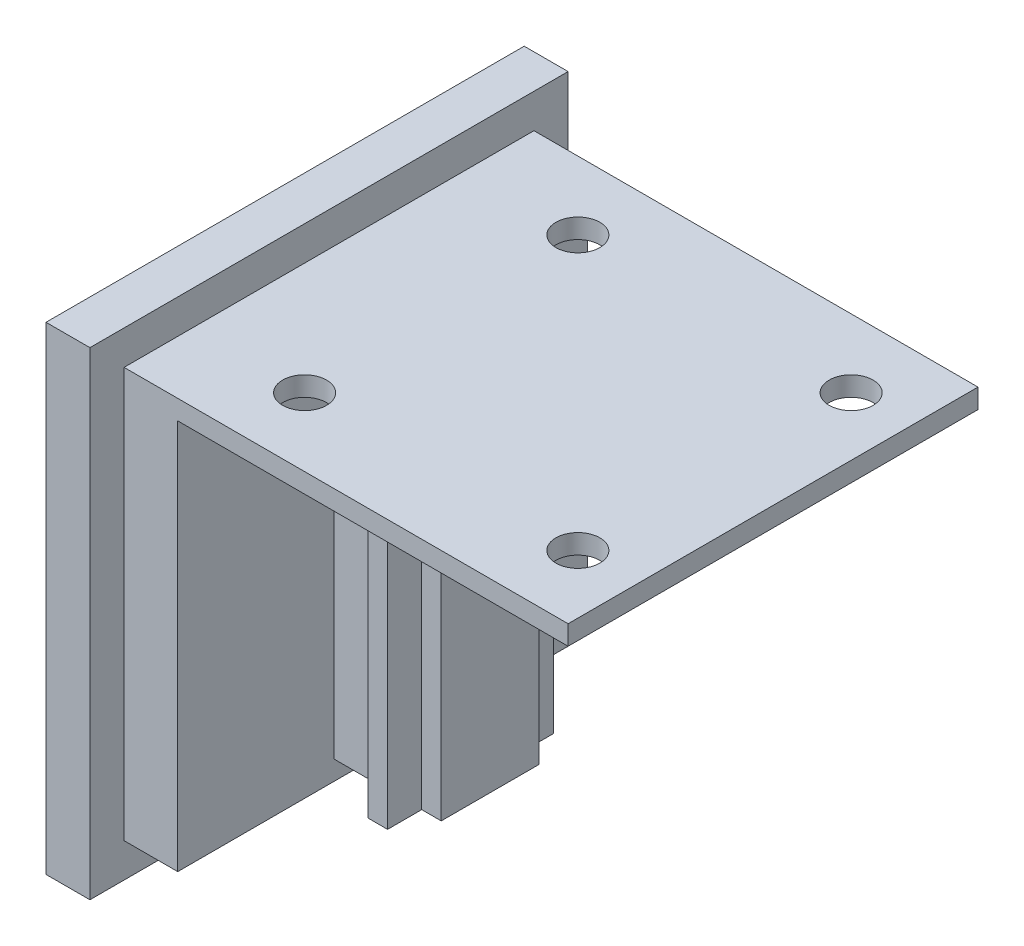
ISO-10303-21;
HEADER;
FILE_DESCRIPTION(('STEP AP214'),'2;1');
FILE_NAME('part.step','',(''),(''),'','','');
FILE_SCHEMA(('AUTOMOTIVE_DESIGN { 1 0 10303 214 1 1 1 1 }'));
ENDSEC;
DATA;
#1=APPLICATION_CONTEXT('core data for automotive mechanical design processes');
#2=APPLICATION_PROTOCOL_DEFINITION('international standard','automotive_design',2000,#1);
#3=PRODUCT_CONTEXT('',#1,'mechanical');
#4=PRODUCT('Part','Part','',(#3));
#5=PRODUCT_RELATED_PRODUCT_CATEGORY('part','',(#4));
#6=PRODUCT_DEFINITION_FORMATION('','',#4);
#7=PRODUCT_DEFINITION_CONTEXT('part definition',#1,'design');
#8=PRODUCT_DEFINITION('design','',#6,#7);
#9=PRODUCT_DEFINITION_SHAPE('','',#8);
#10=(LENGTH_UNIT() NAMED_UNIT(*) SI_UNIT(.MILLI.,.METRE.));
#11=(NAMED_UNIT(*) PLANE_ANGLE_UNIT() SI_UNIT($,.RADIAN.));
#12=(NAMED_UNIT(*) SI_UNIT($,.STERADIAN.) SOLID_ANGLE_UNIT());
#13=UNCERTAINTY_MEASURE_WITH_UNIT(LENGTH_MEASURE(1.E-05),#10,'distance_accuracy_value','');
#14=(GEOMETRIC_REPRESENTATION_CONTEXT(3) GLOBAL_UNCERTAINTY_ASSIGNED_CONTEXT((#13)) GLOBAL_UNIT_ASSIGNED_CONTEXT((#10,
#11,#12)) REPRESENTATION_CONTEXT('',''));
#15=CARTESIAN_POINT('',(0.,0.,0.));
#16=DIRECTION('',(0.,0.,1.));
#17=DIRECTION('',(1.,0.,0.));
#18=AXIS2_PLACEMENT_3D('',#15,#16,#17);
#19=CARTESIAN_POINT('',(50.,19.,-21.));
#20=DIRECTION('',(0.,1.,0.));
#21=DIRECTION('',(0.,0.,1.));
#22=AXIS2_PLACEMENT_3D('',#19,#20,#21);
#23=PLANE('',#22);
#24=CARTESIAN_POINT('',(44.,19.,-14.));
#25=DIRECTION('',(0.,-1.,0.));
#26=DIRECTION('',(0.,0.,-1.));
#27=AXIS2_PLACEMENT_3D('',#24,#25,#26);
#28=CIRCLE('',#27,2.25);
#29=CARTESIAN_POINT('',(44.,19.,-16.25));
#30=VERTEX_POINT('',#29);
#31=EDGE_CURVE('E655',#30,#30,#28,.T.);
#32=ORIENTED_EDGE('',*,*,#31,.F.);
#33=EDGE_LOOP('',(#32));
#34=FACE_BOUND('',#33,.T.);
#35=CARTESIAN_POINT('',(44.,19.,14.));
#36=DIRECTION('',(0.,-1.,0.));
#37=DIRECTION('',(0.,0.,-1.));
#38=AXIS2_PLACEMENT_3D('',#35,#36,#37);
#39=CIRCLE('',#38,2.25);
#40=CARTESIAN_POINT('',(44.,19.,11.75));
#41=VERTEX_POINT('',#40);
#42=EDGE_CURVE('E649',#41,#41,#39,.T.);
#43=ORIENTED_EDGE('',*,*,#42,.F.);
#44=EDGE_LOOP('',(#43));
#45=FACE_BOUND('',#44,.T.);
#46=CARTESIAN_POINT('',(16.,19.,14.));
#47=DIRECTION('',(0.,-1.,0.));
#48=DIRECTION('',(0.,0.,-1.));
#49=AXIS2_PLACEMENT_3D('',#46,#47,#48);
#50=CIRCLE('',#49,2.25);
#51=CARTESIAN_POINT('',(16.,19.,11.75));
#52=VERTEX_POINT('',#51);
#53=EDGE_CURVE('E643',#52,#52,#50,.T.);
#54=ORIENTED_EDGE('',*,*,#53,.F.);
#55=EDGE_LOOP('',(#54));
#56=FACE_BOUND('',#55,.T.);
#57=CARTESIAN_POINT('',(16.,19.,-14.));
#58=DIRECTION('',(0.,-1.,0.));
#59=DIRECTION('',(0.,0.,-1.));
#60=AXIS2_PLACEMENT_3D('',#57,#58,#59);
#61=CIRCLE('',#60,2.25);
#62=CARTESIAN_POINT('',(16.,19.,-16.25));
#63=VERTEX_POINT('',#62);
#64=EDGE_CURVE('E637',#63,#63,#61,.T.);
#65=ORIENTED_EDGE('',*,*,#64,.F.);
#66=EDGE_LOOP('',(#65));
#67=FACE_BOUND('',#66,.T.);
#68=DIRECTION('',(0.,0.,1.));
#69=VECTOR('',#68,1.);
#70=CARTESIAN_POINT('',(17.,19.,-8.5));
#71=LINE('',#70,#69);
#72=CARTESIAN_POINT('',(17.,19.,-8.5));
#73=VERTEX_POINT('',#72);
#74=CARTESIAN_POINT('',(17.,19.,-5.));
#75=VERTEX_POINT('',#74);
#76=EDGE_CURVE('E212',#73,#75,#71,.T.);
#77=ORIENTED_EDGE('',*,*,#76,.T.);
#78=DIRECTION('',(-1.,0.,0.));
#79=VECTOR('',#78,1.);
#80=CARTESIAN_POINT('',(21.,19.,-5.));
#81=LINE('',#80,#79);
#82=CARTESIAN_POINT('',(10.,19.,-5.));
#83=VERTEX_POINT('',#82);
#84=EDGE_CURVE('E264',#75,#83,#81,.T.);
#85=ORIENTED_EDGE('',*,*,#84,.T.);
#86=DIRECTION('',(0.,0.,-1.));
#87=VECTOR('',#86,1.);
#88=CARTESIAN_POINT('',(10.,19.,-21.));
#89=LINE('',#88,#87);
#90=CARTESIAN_POINT('',(10.,19.,-21.));
#91=VERTEX_POINT('',#90);
#92=EDGE_CURVE('E267',#83,#91,#89,.T.);
#93=ORIENTED_EDGE('',*,*,#92,.T.);
#94=DIRECTION('',(-1.,0.,0.));
#95=VECTOR('',#94,1.);
#96=CARTESIAN_POINT('',(50.,19.,-21.));
#97=LINE('',#96,#95);
#98=CARTESIAN_POINT('',(50.,19.,-21.));
#99=VERTEX_POINT('',#98);
#100=EDGE_CURVE('E280',#99,#91,#97,.T.);
#101=ORIENTED_EDGE('',*,*,#100,.F.);
#102=DIRECTION('',(0.,0.,-1.));
#103=VECTOR('',#102,1.);
#104=CARTESIAN_POINT('',(50.,19.,-21.));
#105=LINE('',#104,#103);
#106=CARTESIAN_POINT('',(50.,19.,21.));
#107=VERTEX_POINT('',#106);
#108=EDGE_CURVE('E271',#107,#99,#105,.T.);
#109=ORIENTED_EDGE('',*,*,#108,.F.);
#110=DIRECTION('',(-1.,0.,0.));
#111=VECTOR('',#110,1.);
#112=CARTESIAN_POINT('',(50.,19.,21.));
#113=LINE('',#112,#111);
#114=CARTESIAN_POINT('',(10.,19.,21.));
#115=VERTEX_POINT('',#114);
#116=EDGE_CURVE('E285',#107,#115,#113,.T.);
#117=ORIENTED_EDGE('',*,*,#116,.T.);
#118=CARTESIAN_POINT('',(10.,19.,5.));
#119=VERTEX_POINT('',#118);
#120=EDGE_CURVE('E272',#115,#119,#89,.T.);
#121=ORIENTED_EDGE('',*,*,#120,.T.);
#122=DIRECTION('',(-1.,0.,0.));
#123=VECTOR('',#122,1.);
#124=CARTESIAN_POINT('',(21.,19.,5.));
#125=LINE('',#124,#123);
#126=CARTESIAN_POINT('',(17.,19.,5.));
#127=VERTEX_POINT('',#126);
#128=EDGE_CURVE('E260',#127,#119,#125,.T.);
#129=ORIENTED_EDGE('',*,*,#128,.F.);
#130=DIRECTION('',(0.,0.,-1.));
#131=VECTOR('',#130,1.);
#132=CARTESIAN_POINT('',(17.,19.,8.5));
#133=LINE('',#132,#131);
#134=CARTESIAN_POINT('',(17.,19.,8.5));
#135=VERTEX_POINT('',#134);
#136=EDGE_CURVE('E231',#135,#127,#133,.T.);
#137=ORIENTED_EDGE('',*,*,#136,.F.);
#138=DIRECTION('',(-1.,0.,0.));
#139=VECTOR('',#138,1.);
#140=CARTESIAN_POINT('',(17.,19.,8.5));
#141=LINE('',#140,#139);
#142=CARTESIAN_POINT('',(19.,19.,8.5));
#143=VERTEX_POINT('',#142);
#144=EDGE_CURVE('E217',#143,#135,#141,.T.);
#145=ORIENTED_EDGE('',*,*,#144,.F.);
#146=DIRECTION('',(0.,0.,-1.));
#147=VECTOR('',#146,1.);
#148=CARTESIAN_POINT('',(19.,19.,8.5));
#149=LINE('',#148,#147);
#150=CARTESIAN_POINT('',(19.,19.,5.));
#151=VERTEX_POINT('',#150);
#152=EDGE_CURVE('E233',#143,#151,#149,.T.);
#153=ORIENTED_EDGE('',*,*,#152,.T.);
#154=CARTESIAN_POINT('',(21.,19.,5.));
#155=VERTEX_POINT('',#154);
#156=EDGE_CURVE('E261',#155,#151,#125,.T.);
#157=ORIENTED_EDGE('',*,*,#156,.F.);
#158=DIRECTION('',(0.,0.,1.));
#159=VECTOR('',#158,1.);
#160=CARTESIAN_POINT('',(21.,19.,5.));
#161=LINE('',#160,#159);
#162=CARTESIAN_POINT('',(21.,19.,-5.));
#163=VERTEX_POINT('',#162);
#164=EDGE_CURVE('E240',#163,#155,#161,.T.);
#165=ORIENTED_EDGE('',*,*,#164,.F.);
#166=CARTESIAN_POINT('',(19.,19.,-5.));
#167=VERTEX_POINT('',#166);
#168=EDGE_CURVE('E265',#163,#167,#81,.T.);
#169=ORIENTED_EDGE('',*,*,#168,.T.);
#170=DIRECTION('',(0.,0.,1.));
#171=VECTOR('',#170,1.);
#172=CARTESIAN_POINT('',(19.,19.,-8.5));
#173=LINE('',#172,#171);
#174=CARTESIAN_POINT('',(19.,19.,-8.5));
#175=VERTEX_POINT('',#174);
#176=EDGE_CURVE('E53',#175,#167,#173,.T.);
#177=ORIENTED_EDGE('',*,*,#176,.F.);
#178=DIRECTION('',(1.,0.,0.));
#179=VECTOR('',#178,1.);
#180=CARTESIAN_POINT('',(19.,19.,-8.5));
#181=LINE('',#180,#179);
#182=EDGE_CURVE('E48',#73,#175,#181,.T.);
#183=ORIENTED_EDGE('',*,*,#182,.F.);
#184=EDGE_LOOP('',(#77,#85,#93,#101,#109,#117,#121,#129,#137,#145,#153,#157,#165,#169,#177,#183));
#185=FACE_BOUND('',#184,.T.);
#186=ADVANCED_FACE('F33',(#34,#45,#56,#67,#185),#23,.F.);
#187=CARTESIAN_POINT('',(21.,19.,-5.));
#188=DIRECTION('',(0.,0.,1.));
#189=DIRECTION('',(1.,0.,0.));
#190=AXIS2_PLACEMENT_3D('',#187,#188,#189);
#191=PLANE('',#190);
#192=DIRECTION('',(0.,1.,0.));
#193=VECTOR('',#192,1.);
#194=CARTESIAN_POINT('',(17.,19.,-5.));
#195=LINE('',#194,#193);
#196=CARTESIAN_POINT('',(17.,-19.,-5.));
#197=VERTEX_POINT('',#196);
#198=EDGE_CURVE('E205',#197,#75,#195,.T.);
#199=ORIENTED_EDGE('',*,*,#198,.F.);
#200=DIRECTION('',(-1.,0.,0.));
#201=VECTOR('',#200,1.);
#202=CARTESIAN_POINT('',(21.,-19.,-5.));
#203=LINE('',#202,#201);
#204=CARTESIAN_POINT('',(10.,-19.,-5.));
#205=VERTEX_POINT('',#204);
#206=EDGE_CURVE('E247',#197,#205,#203,.T.);
#207=ORIENTED_EDGE('',*,*,#206,.T.);
#208=DIRECTION('',(0.,1.,0.));
#209=VECTOR('',#208,1.);
#210=CARTESIAN_POINT('',(10.,19.,-5.));
#211=LINE('',#210,#209);
#212=EDGE_CURVE('E236',#205,#83,#211,.T.);
#213=ORIENTED_EDGE('',*,*,#212,.T.);
#214=ORIENTED_EDGE('',*,*,#84,.F.);
#215=EDGE_LOOP('',(#199,#207,#213,#214));
#216=FACE_BOUND('',#215,.T.);
#217=ADVANCED_FACE('F372',(#216),#191,.F.);
#218=DIRECTION('',(0.,-1.,0.));
#219=VECTOR('',#218,1.);
#220=CARTESIAN_POINT('',(19.,19.,-5.));
#221=LINE('',#220,#219);
#222=CARTESIAN_POINT('',(19.,-19.,-5.));
#223=VERTEX_POINT('',#222);
#224=EDGE_CURVE('E192',#167,#223,#221,.T.);
#225=ORIENTED_EDGE('',*,*,#224,.F.);
#226=ORIENTED_EDGE('',*,*,#168,.F.);
#227=DIRECTION('',(0.,1.,0.));
#228=VECTOR('',#227,1.);
#229=CARTESIAN_POINT('',(21.,19.,-5.));
#230=LINE('',#229,#228);
#231=CARTESIAN_POINT('',(21.,-19.,-5.));
#232=VERTEX_POINT('',#231);
#233=EDGE_CURVE('E237',#232,#163,#230,.T.);
#234=ORIENTED_EDGE('',*,*,#233,.F.);
#235=EDGE_CURVE('E254',#232,#223,#203,.T.);
#236=ORIENTED_EDGE('',*,*,#235,.T.);
#237=EDGE_LOOP('',(#225,#226,#234,#236));
#238=FACE_BOUND('',#237,.T.);
#239=ADVANCED_FACE('F379',(#238),#191,.F.);
#240=CARTESIAN_POINT('',(21.,19.,5.));
#241=DIRECTION('',(0.,0.,-1.));
#242=DIRECTION('',(-1.,0.,0.));
#243=AXIS2_PLACEMENT_3D('',#240,#241,#242);
#244=PLANE('',#243);
#245=DIRECTION('',(0.,1.,0.));
#246=VECTOR('',#245,1.);
#247=CARTESIAN_POINT('',(19.,19.,5.));
#248=LINE('',#247,#246);
#249=CARTESIAN_POINT('',(19.,-19.,5.));
#250=VERTEX_POINT('',#249);
#251=EDGE_CURVE('E214',#250,#151,#248,.T.);
#252=ORIENTED_EDGE('',*,*,#251,.F.);
#253=DIRECTION('',(-1.,0.,0.));
#254=VECTOR('',#253,1.);
#255=CARTESIAN_POINT('',(21.,-19.,5.));
#256=LINE('',#255,#254);
#257=CARTESIAN_POINT('',(21.,-19.,5.));
#258=VERTEX_POINT('',#257);
#259=EDGE_CURVE('E257',#258,#250,#256,.T.);
#260=ORIENTED_EDGE('',*,*,#259,.F.);
#261=DIRECTION('',(0.,-1.,0.));
#262=VECTOR('',#261,1.);
#263=CARTESIAN_POINT('',(21.,19.,5.));
#264=LINE('',#263,#262);
#265=EDGE_CURVE('E243',#155,#258,#264,.T.);
#266=ORIENTED_EDGE('',*,*,#265,.F.);
#267=ORIENTED_EDGE('',*,*,#156,.T.);
#268=EDGE_LOOP('',(#252,#260,#266,#267));
#269=FACE_BOUND('',#268,.T.);
#270=ADVANCED_FACE('F466',(#269),#244,.F.);
#271=DIRECTION('',(0.,-1.,0.));
#272=VECTOR('',#271,1.);
#273=CARTESIAN_POINT('',(17.,19.,5.));
#274=LINE('',#273,#272);
#275=CARTESIAN_POINT('',(17.,-19.,5.));
#276=VERTEX_POINT('',#275);
#277=EDGE_CURVE('E218',#127,#276,#274,.T.);
#278=ORIENTED_EDGE('',*,*,#277,.F.);
#279=ORIENTED_EDGE('',*,*,#128,.T.);
#280=DIRECTION('',(0.,-1.,0.));
#281=VECTOR('',#280,1.);
#282=CARTESIAN_POINT('',(10.,19.,5.));
#283=LINE('',#282,#281);
#284=CARTESIAN_POINT('',(10.,-19.,5.));
#285=VERTEX_POINT('',#284);
#286=EDGE_CURVE('E250',#119,#285,#283,.T.);
#287=ORIENTED_EDGE('',*,*,#286,.T.);
#288=EDGE_CURVE('E256',#276,#285,#256,.T.);
#289=ORIENTED_EDGE('',*,*,#288,.F.);
#290=EDGE_LOOP('',(#278,#279,#287,#289));
#291=FACE_BOUND('',#290,.T.);
#292=ADVANCED_FACE('F390',(#291),#244,.F.);
#293=CARTESIAN_POINT('',(10.,0.,0.));
#294=DIRECTION('',(1.,0.,0.));
#295=DIRECTION('',(0.,0.,-1.));
#296=AXIS2_PLACEMENT_3D('',#293,#294,#295);
#297=PLANE('',#296);
#298=ORIENTED_EDGE('',*,*,#92,.F.);
#299=ORIENTED_EDGE('',*,*,#212,.F.);
#300=DIRECTION('',(0.,0.,-1.));
#301=VECTOR('',#300,1.);
#302=CARTESIAN_POINT('',(10.,-19.,5.));
#303=LINE('',#302,#301);
#304=EDGE_CURVE('E241',#285,#205,#303,.T.);
#305=ORIENTED_EDGE('',*,*,#304,.F.);
#306=ORIENTED_EDGE('',*,*,#286,.F.);
#307=ORIENTED_EDGE('',*,*,#120,.F.);
#308=DIRECTION('',(0.,-1.,0.));
#309=VECTOR('',#308,1.);
#310=CARTESIAN_POINT('',(10.,21.,21.));
#311=LINE('',#310,#309);
#312=CARTESIAN_POINT('',(10.,-21.,21.));
#313=VERTEX_POINT('',#312);
#314=EDGE_CURVE('E292',#115,#313,#311,.T.);
#315=ORIENTED_EDGE('',*,*,#314,.T.);
#316=DIRECTION('',(0.,0.,-1.));
#317=VECTOR('',#316,1.);
#318=CARTESIAN_POINT('',(10.,-21.,21.));
#319=LINE('',#318,#317);
#320=CARTESIAN_POINT('',(10.,-21.,-21.));
#321=VERTEX_POINT('',#320);
#322=EDGE_CURVE('E295',#313,#321,#319,.T.);
#323=ORIENTED_EDGE('',*,*,#322,.T.);
#324=DIRECTION('',(0.,1.,0.));
#325=VECTOR('',#324,1.);
#326=CARTESIAN_POINT('',(10.,21.,-21.));
#327=LINE('',#326,#325);
#328=EDGE_CURVE('E289',#321,#91,#327,.T.);
#329=ORIENTED_EDGE('',*,*,#328,.T.);
#330=EDGE_LOOP('',(#298,#299,#305,#306,#307,#315,#323,#329));
#331=FACE_BOUND('',#330,.T.);
#332=ADVANCED_FACE('F387',(#331),#297,.T.);
#333=CARTESIAN_POINT('',(4.5,0.,0.));
#334=DIRECTION('',(-1.,0.,0.));
#335=DIRECTION('',(0.,0.,1.));
#336=AXIS2_PLACEMENT_3D('',#333,#334,#335);
#337=PLANE('',#336);
#338=DIRECTION('',(0.,-1.,0.));
#339=VECTOR('',#338,1.);
#340=CARTESIAN_POINT('',(4.5,24.5,24.5));
#341=LINE('',#340,#339);
#342=CARTESIAN_POINT('',(4.5,24.5,24.5));
#343=VERTEX_POINT('',#342);
#344=CARTESIAN_POINT('',(4.5,-24.5,24.5));
#345=VERTEX_POINT('',#344);
#346=EDGE_CURVE('E320',#343,#345,#341,.T.);
#347=ORIENTED_EDGE('',*,*,#346,.T.);
#348=DIRECTION('',(0.,0.,-1.));
#349=VECTOR('',#348,1.);
#350=CARTESIAN_POINT('',(4.5,-24.5,-24.5));
#351=LINE('',#350,#349);
#352=CARTESIAN_POINT('',(4.5,-24.5,-24.5));
#353=VERTEX_POINT('',#352);
#354=EDGE_CURVE('E323',#345,#353,#351,.T.);
#355=ORIENTED_EDGE('',*,*,#354,.T.);
#356=DIRECTION('',(0.,1.,0.));
#357=VECTOR('',#356,1.);
#358=CARTESIAN_POINT('',(4.5,24.5,-24.5));
#359=LINE('',#358,#357);
#360=CARTESIAN_POINT('',(4.5,24.5,-24.5));
#361=VERTEX_POINT('',#360);
#362=EDGE_CURVE('E326',#353,#361,#359,.T.);
#363=ORIENTED_EDGE('',*,*,#362,.T.);
#364=DIRECTION('',(0.,0.,1.));
#365=VECTOR('',#364,1.);
#366=CARTESIAN_POINT('',(4.5,24.5,-24.5));
#367=LINE('',#366,#365);
#368=EDGE_CURVE('E328',#361,#343,#367,.T.);
#369=ORIENTED_EDGE('',*,*,#368,.T.);
#370=EDGE_LOOP('',(#347,#355,#363,#369));
#371=FACE_BOUND('',#370,.T.);
#372=DIRECTION('',(0.,1.,0.));
#373=VECTOR('',#372,1.);
#374=CARTESIAN_POINT('',(4.5,21.,-21.));
#375=LINE('',#374,#373);
#376=CARTESIAN_POINT('',(4.5,-21.,-21.));
#377=VERTEX_POINT('',#376);
#378=CARTESIAN_POINT('',(4.5,21.,-21.));
#379=VERTEX_POINT('',#378);
#380=EDGE_CURVE('E288',#377,#379,#375,.T.);
#381=ORIENTED_EDGE('',*,*,#380,.F.);
#382=DIRECTION('',(0.,0.,-1.));
#383=VECTOR('',#382,1.);
#384=CARTESIAN_POINT('',(4.5,-21.,21.));
#385=LINE('',#384,#383);
#386=CARTESIAN_POINT('',(4.5,-21.,21.));
#387=VERTEX_POINT('',#386);
#388=EDGE_CURVE('E293',#387,#377,#385,.T.);
#389=ORIENTED_EDGE('',*,*,#388,.F.);
#390=DIRECTION('',(0.,-1.,0.));
#391=VECTOR('',#390,1.);
#392=CARTESIAN_POINT('',(4.5,21.,21.));
#393=LINE('',#392,#391);
#394=CARTESIAN_POINT('',(4.5,21.,21.));
#395=VERTEX_POINT('',#394);
#396=EDGE_CURVE('E303',#395,#387,#393,.T.);
#397=ORIENTED_EDGE('',*,*,#396,.F.);
#398=DIRECTION('',(0.,0.,1.));
#399=VECTOR('',#398,1.);
#400=CARTESIAN_POINT('',(4.5,21.,21.));
#401=LINE('',#400,#399);
#402=EDGE_CURVE('E300',#379,#395,#401,.T.);
#403=ORIENTED_EDGE('',*,*,#402,.F.);
#404=EDGE_LOOP('',(#381,#389,#397,#403));
#405=FACE_BOUND('',#404,.T.);
#406=ADVANCED_FACE('F362',(#371,#405),#337,.F.);
#407=CARTESIAN_POINT('',(4.5,24.5,24.5));
#408=DIRECTION('',(0.,0.,-1.));
#409=DIRECTION('',(0.,1.,0.));
#410=AXIS2_PLACEMENT_3D('',#407,#408,#409);
#411=PLANE('',#410);
#412=DIRECTION('',(0.,-1.,0.));
#413=VECTOR('',#412,1.);
#414=CARTESIAN_POINT('',(0.,24.5,24.5));
#415=LINE('',#414,#413);
#416=CARTESIAN_POINT('',(0.,24.5,24.5));
#417=VERTEX_POINT('',#416);
#418=CARTESIAN_POINT('',(0.,-24.5,24.5));
#419=VERTEX_POINT('',#418);
#420=EDGE_CURVE('E319',#417,#419,#415,.T.);
#421=ORIENTED_EDGE('',*,*,#420,.T.);
#422=DIRECTION('',(-1.,0.,0.));
#423=VECTOR('',#422,1.);
#424=CARTESIAN_POINT('',(4.5,-24.5,24.5));
#425=LINE('',#424,#423);
#426=EDGE_CURVE('E11',#345,#419,#425,.T.);
#427=ORIENTED_EDGE('',*,*,#426,.F.);
#428=ORIENTED_EDGE('',*,*,#346,.F.);
#429=DIRECTION('',(-1.,0.,0.));
#430=VECTOR('',#429,1.);
#431=CARTESIAN_POINT('',(4.5,24.5,24.5));
#432=LINE('',#431,#430);
#433=EDGE_CURVE('E330',#343,#417,#432,.T.);
#434=ORIENTED_EDGE('',*,*,#433,.T.);
#435=EDGE_LOOP('',(#421,#427,#428,#434));
#436=FACE_BOUND('',#435,.T.);
#437=ADVANCED_FACE('F35',(#436),#411,.F.);
#438=CARTESIAN_POINT('',(4.5,-24.5,-24.5));
#439=DIRECTION('',(0.,1.,0.));
#440=DIRECTION('',(0.,0.,1.));
#441=AXIS2_PLACEMENT_3D('',#438,#439,#440);
#442=PLANE('',#441);
#443=DIRECTION('',(0.,0.,-1.));
#444=VECTOR('',#443,1.);
#445=CARTESIAN_POINT('',(0.,-24.5,-24.5));
#446=LINE('',#445,#444);
#447=CARTESIAN_POINT('',(0.,-24.5,-24.5));
#448=VERTEX_POINT('',#447);
#449=EDGE_CURVE('E333',#419,#448,#446,.T.);
#450=ORIENTED_EDGE('',*,*,#449,.T.);
#451=DIRECTION('',(-1.,0.,0.));
#452=VECTOR('',#451,1.);
#453=CARTESIAN_POINT('',(4.5,-24.5,-24.5));
#454=LINE('',#453,#452);
#455=EDGE_CURVE('E41',#353,#448,#454,.T.);
#456=ORIENTED_EDGE('',*,*,#455,.F.);
#457=ORIENTED_EDGE('',*,*,#354,.F.);
#458=ORIENTED_EDGE('',*,*,#426,.T.);
#459=EDGE_LOOP('',(#450,#456,#457,#458));
#460=FACE_BOUND('',#459,.T.);
#461=ADVANCED_FACE('F364',(#460),#442,.F.);
#462=CARTESIAN_POINT('',(4.5,24.5,-24.5));
#463=DIRECTION('',(0.,0.,1.));
#464=DIRECTION('',(0.,-1.,0.));
#465=AXIS2_PLACEMENT_3D('',#462,#463,#464);
#466=PLANE('',#465);
#467=DIRECTION('',(0.,1.,0.));
#468=VECTOR('',#467,1.);
#469=CARTESIAN_POINT('',(0.,24.5,-24.5));
#470=LINE('',#469,#468);
#471=CARTESIAN_POINT('',(0.,24.5,-24.5));
#472=VERTEX_POINT('',#471);
#473=EDGE_CURVE('E335',#448,#472,#470,.T.);
#474=ORIENTED_EDGE('',*,*,#473,.T.);
#475=DIRECTION('',(-1.,0.,0.));
#476=VECTOR('',#475,1.);
#477=CARTESIAN_POINT('',(4.5,24.5,-24.5));
#478=LINE('',#477,#476);
#479=EDGE_CURVE('E340',#361,#472,#478,.T.);
#480=ORIENTED_EDGE('',*,*,#479,.F.);
#481=ORIENTED_EDGE('',*,*,#362,.F.);
#482=ORIENTED_EDGE('',*,*,#455,.T.);
#483=EDGE_LOOP('',(#474,#480,#481,#482));
#484=FACE_BOUND('',#483,.T.);
#485=ADVANCED_FACE('F347',(#484),#466,.F.);
#486=CARTESIAN_POINT('',(4.5,24.5,-24.5));
#487=DIRECTION('',(0.,-1.,0.));
#488=DIRECTION('',(0.,0.,-1.));
#489=AXIS2_PLACEMENT_3D('',#486,#487,#488);
#490=PLANE('',#489);
#491=DIRECTION('',(0.,0.,1.));
#492=VECTOR('',#491,1.);
#493=CARTESIAN_POINT('',(0.,24.5,-24.5));
#494=LINE('',#493,#492);
#495=EDGE_CURVE('E324',#472,#417,#494,.T.);
#496=ORIENTED_EDGE('',*,*,#495,.T.);
#497=ORIENTED_EDGE('',*,*,#433,.F.);
#498=ORIENTED_EDGE('',*,*,#368,.F.);
#499=ORIENTED_EDGE('',*,*,#479,.T.);
#500=EDGE_LOOP('',(#496,#497,#498,#499));
#501=FACE_BOUND('',#500,.T.);
#502=ADVANCED_FACE('F356',(#501),#490,.F.);
#503=CARTESIAN_POINT('',(0.,0.,0.));
#504=DIRECTION('',(-1.,0.,0.));
#505=DIRECTION('',(0.,0.,1.));
#506=AXIS2_PLACEMENT_3D('',#503,#504,#505);
#507=PLANE('',#506);
#508=ORIENTED_EDGE('',*,*,#420,.F.);
#509=ORIENTED_EDGE('',*,*,#495,.F.);
#510=ORIENTED_EDGE('',*,*,#473,.F.);
#511=ORIENTED_EDGE('',*,*,#449,.F.);
#512=EDGE_LOOP('',(#508,#509,#510,#511));
#513=FACE_BOUND('',#512,.T.);
#514=ADVANCED_FACE('F353',(#513),#507,.T.);
#515=CARTESIAN_POINT('',(10.,21.,-21.));
#516=DIRECTION('',(0.,0.,1.));
#517=DIRECTION('',(1.,0.,0.));
#518=AXIS2_PLACEMENT_3D('',#515,#516,#517);
#519=PLANE('',#518);
#520=ORIENTED_EDGE('',*,*,#380,.T.);
#521=DIRECTION('',(-1.,0.,0.));
#522=VECTOR('',#521,1.);
#523=CARTESIAN_POINT('',(10.,21.,-21.));
#524=LINE('',#523,#522);
#525=CARTESIAN_POINT('',(50.,21.,-21.));
#526=VERTEX_POINT('',#525);
#527=EDGE_CURVE('E316',#526,#379,#524,.T.);
#528=ORIENTED_EDGE('',*,*,#527,.F.);
#529=DIRECTION('',(0.,1.,0.));
#530=VECTOR('',#529,1.);
#531=CARTESIAN_POINT('',(50.,21.,-21.));
#532=LINE('',#531,#530);
#533=EDGE_CURVE('E274',#99,#526,#532,.T.);
#534=ORIENTED_EDGE('',*,*,#533,.F.);
#535=ORIENTED_EDGE('',*,*,#100,.T.);
#536=ORIENTED_EDGE('',*,*,#328,.F.);
#537=DIRECTION('',(-1.,0.,0.));
#538=VECTOR('',#537,1.);
#539=CARTESIAN_POINT('',(10.,-21.,-21.));
#540=LINE('',#539,#538);
#541=EDGE_CURVE('E297',#321,#377,#540,.T.);
#542=ORIENTED_EDGE('',*,*,#541,.T.);
#543=EDGE_LOOP('',(#520,#528,#534,#535,#536,#542));
#544=FACE_BOUND('',#543,.T.);
#545=ADVANCED_FACE('F403',(#544),#519,.F.);
#546=CARTESIAN_POINT('',(10.,21.,21.));
#547=DIRECTION('',(0.,-1.,0.));
#548=DIRECTION('',(0.,0.,-1.));
#549=AXIS2_PLACEMENT_3D('',#546,#547,#548);
#550=PLANE('',#549);
#551=CARTESIAN_POINT('',(44.,21.,-14.));
#552=DIRECTION('',(0.,-1.,0.));
#553=DIRECTION('',(0.,0.,-1.));
#554=AXIS2_PLACEMENT_3D('',#551,#552,#553);
#555=CIRCLE('',#554,2.25);
#556=CARTESIAN_POINT('',(44.,21.,-16.25));
#557=VERTEX_POINT('',#556);
#558=EDGE_CURVE('E652',#557,#557,#555,.T.);
#559=ORIENTED_EDGE('',*,*,#558,.T.);
#560=EDGE_LOOP('',(#559));
#561=FACE_BOUND('',#560,.T.);
#562=CARTESIAN_POINT('',(44.,21.,14.));
#563=DIRECTION('',(0.,-1.,0.));
#564=DIRECTION('',(0.,0.,-1.));
#565=AXIS2_PLACEMENT_3D('',#562,#563,#564);
#566=CIRCLE('',#565,2.25);
#567=CARTESIAN_POINT('',(44.,21.,11.75));
#568=VERTEX_POINT('',#567);
#569=EDGE_CURVE('E646',#568,#568,#566,.T.);
#570=ORIENTED_EDGE('',*,*,#569,.T.);
#571=EDGE_LOOP('',(#570));
#572=FACE_BOUND('',#571,.T.);
#573=CARTESIAN_POINT('',(16.,21.,14.));
#574=DIRECTION('',(0.,-1.,0.));
#575=DIRECTION('',(0.,0.,-1.));
#576=AXIS2_PLACEMENT_3D('',#573,#574,#575);
#577=CIRCLE('',#576,2.25);
#578=CARTESIAN_POINT('',(16.,21.,11.75));
#579=VERTEX_POINT('',#578);
#580=EDGE_CURVE('E640',#579,#579,#577,.T.);
#581=ORIENTED_EDGE('',*,*,#580,.T.);
#582=EDGE_LOOP('',(#581));
#583=FACE_BOUND('',#582,.T.);
#584=CARTESIAN_POINT('',(16.,21.,-14.));
#585=DIRECTION('',(0.,-1.,0.));
#586=DIRECTION('',(0.,0.,-1.));
#587=AXIS2_PLACEMENT_3D('',#584,#585,#586);
#588=CIRCLE('',#587,2.25);
#589=CARTESIAN_POINT('',(16.,21.,-16.25));
#590=VERTEX_POINT('',#589);
#591=EDGE_CURVE('E208',#590,#590,#588,.T.);
#592=ORIENTED_EDGE('',*,*,#591,.T.);
#593=EDGE_LOOP('',(#592));
#594=FACE_BOUND('',#593,.T.);
#595=ORIENTED_EDGE('',*,*,#402,.T.);
#596=DIRECTION('',(-1.,0.,0.));
#597=VECTOR('',#596,1.);
#598=CARTESIAN_POINT('',(10.,21.,21.));
#599=LINE('',#598,#597);
#600=CARTESIAN_POINT('',(50.,21.,21.));
#601=VERTEX_POINT('',#600);
#602=EDGE_CURVE('E313',#601,#395,#599,.T.);
#603=ORIENTED_EDGE('',*,*,#602,.F.);
#604=DIRECTION('',(0.,0.,1.));
#605=VECTOR('',#604,1.);
#606=CARTESIAN_POINT('',(50.,21.,-21.));
#607=LINE('',#606,#605);
#608=EDGE_CURVE('E277',#526,#601,#607,.T.);
#609=ORIENTED_EDGE('',*,*,#608,.F.);
#610=ORIENTED_EDGE('',*,*,#527,.T.);
#611=EDGE_LOOP('',(#595,#603,#609,#610));
#612=FACE_BOUND('',#611,.T.);
#613=ADVANCED_FACE('F399',(#561,#572,#583,#594,#612),#550,.F.);
#614=CARTESIAN_POINT('',(10.,21.,21.));
#615=DIRECTION('',(0.,0.,-1.));
#616=DIRECTION('',(-1.,0.,0.));
#617=AXIS2_PLACEMENT_3D('',#614,#615,#616);
#618=PLANE('',#617);
#619=ORIENTED_EDGE('',*,*,#396,.T.);
#620=DIRECTION('',(-1.,0.,0.));
#621=VECTOR('',#620,1.);
#622=CARTESIAN_POINT('',(10.,-21.,21.));
#623=LINE('',#622,#621);
#624=EDGE_CURVE('E310',#313,#387,#623,.T.);
#625=ORIENTED_EDGE('',*,*,#624,.F.);
#626=ORIENTED_EDGE('',*,*,#314,.F.);
#627=ORIENTED_EDGE('',*,*,#116,.F.);
#628=DIRECTION('',(0.,-1.,0.));
#629=VECTOR('',#628,1.);
#630=CARTESIAN_POINT('',(50.,21.,21.));
#631=LINE('',#630,#629);
#632=EDGE_CURVE('E268',#601,#107,#631,.T.);
#633=ORIENTED_EDGE('',*,*,#632,.F.);
#634=ORIENTED_EDGE('',*,*,#602,.T.);
#635=EDGE_LOOP('',(#619,#625,#626,#627,#633,#634));
#636=FACE_BOUND('',#635,.T.);
#637=ADVANCED_FACE('F395',(#636),#618,.F.);
#638=CARTESIAN_POINT('',(10.,-21.,21.));
#639=DIRECTION('',(0.,1.,0.));
#640=DIRECTION('',(0.,0.,1.));
#641=AXIS2_PLACEMENT_3D('',#638,#639,#640);
#642=PLANE('',#641);
#643=ORIENTED_EDGE('',*,*,#388,.T.);
#644=ORIENTED_EDGE('',*,*,#541,.F.);
#645=ORIENTED_EDGE('',*,*,#322,.F.);
#646=ORIENTED_EDGE('',*,*,#624,.T.);
#647=EDGE_LOOP('',(#643,#644,#645,#646));
#648=FACE_BOUND('',#647,.T.);
#649=ADVANCED_FACE('F392',(#648),#642,.F.);
#650=CARTESIAN_POINT('',(50.,0.,0.));
#651=DIRECTION('',(-1.,0.,0.));
#652=DIRECTION('',(0.,0.,1.));
#653=AXIS2_PLACEMENT_3D('',#650,#651,#652);
#654=PLANE('',#653);
#655=ORIENTED_EDGE('',*,*,#632,.T.);
#656=ORIENTED_EDGE('',*,*,#108,.T.);
#657=ORIENTED_EDGE('',*,*,#533,.T.);
#658=ORIENTED_EDGE('',*,*,#608,.T.);
#659=EDGE_LOOP('',(#655,#656,#657,#658));
#660=FACE_BOUND('',#659,.T.);
#661=ADVANCED_FACE('F386',(#660),#654,.F.);
#662=CARTESIAN_POINT('',(21.,-19.,5.));
#663=DIRECTION('',(0.,1.,0.));
#664=DIRECTION('',(0.,0.,1.));
#665=AXIS2_PLACEMENT_3D('',#662,#663,#664);
#666=PLANE('',#665);
#667=ORIENTED_EDGE('',*,*,#304,.T.);
#668=ORIENTED_EDGE('',*,*,#206,.F.);
#669=DIRECTION('',(0.,0.,1.));
#670=VECTOR('',#669,1.);
#671=CARTESIAN_POINT('',(17.,-19.,-8.5));
#672=LINE('',#671,#670);
#673=CARTESIAN_POINT('',(17.,-19.,-8.5));
#674=VERTEX_POINT('',#673);
#675=EDGE_CURVE('E195',#674,#197,#672,.T.);
#676=ORIENTED_EDGE('',*,*,#675,.F.);
#677=DIRECTION('',(-1.,0.,0.));
#678=VECTOR('',#677,1.);
#679=CARTESIAN_POINT('',(19.,-19.,-8.5));
#680=LINE('',#679,#678);
#681=CARTESIAN_POINT('',(19.,-19.,-8.5));
#682=VERTEX_POINT('',#681);
#683=EDGE_CURVE('E184',#682,#674,#680,.T.);
#684=ORIENTED_EDGE('',*,*,#683,.F.);
#685=DIRECTION('',(0.,0.,1.));
#686=VECTOR('',#685,1.);
#687=CARTESIAN_POINT('',(19.,-19.,-8.5));
#688=LINE('',#687,#686);
#689=EDGE_CURVE('E190',#682,#223,#688,.T.);
#690=ORIENTED_EDGE('',*,*,#689,.T.);
#691=ORIENTED_EDGE('',*,*,#235,.F.);
#692=DIRECTION('',(0.,0.,-1.));
#693=VECTOR('',#692,1.);
#694=CARTESIAN_POINT('',(21.,-19.,5.));
#695=LINE('',#694,#693);
#696=EDGE_CURVE('E245',#258,#232,#695,.T.);
#697=ORIENTED_EDGE('',*,*,#696,.F.);
#698=ORIENTED_EDGE('',*,*,#259,.T.);
#699=DIRECTION('',(0.,0.,-1.));
#700=VECTOR('',#699,1.);
#701=CARTESIAN_POINT('',(19.,-19.,8.5));
#702=LINE('',#701,#700);
#703=CARTESIAN_POINT('',(19.,-19.,8.5));
#704=VERTEX_POINT('',#703);
#705=EDGE_CURVE('E224',#704,#250,#702,.T.);
#706=ORIENTED_EDGE('',*,*,#705,.F.);
#707=DIRECTION('',(1.,0.,0.));
#708=VECTOR('',#707,1.);
#709=CARTESIAN_POINT('',(17.,-19.,8.5));
#710=LINE('',#709,#708);
#711=CARTESIAN_POINT('',(17.,-19.,8.5));
#712=VERTEX_POINT('',#711);
#713=EDGE_CURVE('E222',#712,#704,#710,.T.);
#714=ORIENTED_EDGE('',*,*,#713,.F.);
#715=DIRECTION('',(0.,0.,-1.));
#716=VECTOR('',#715,1.);
#717=CARTESIAN_POINT('',(17.,-19.,8.5));
#718=LINE('',#717,#716);
#719=EDGE_CURVE('E229',#712,#276,#718,.T.);
#720=ORIENTED_EDGE('',*,*,#719,.T.);
#721=ORIENTED_EDGE('',*,*,#288,.T.);
#722=EDGE_LOOP('',(#667,#668,#676,#684,#690,#691,#697,#698,#706,#714,#720,#721));
#723=FACE_BOUND('',#722,.T.);
#724=ADVANCED_FACE('F198',(#723),#666,.F.);
#725=CARTESIAN_POINT('',(21.,0.,0.));
#726=DIRECTION('',(1.,0.,0.));
#727=DIRECTION('',(0.,0.,-1.));
#728=AXIS2_PLACEMENT_3D('',#725,#726,#727);
#729=PLANE('',#728);
#730=ORIENTED_EDGE('',*,*,#233,.T.);
#731=ORIENTED_EDGE('',*,*,#164,.T.);
#732=ORIENTED_EDGE('',*,*,#265,.T.);
#733=ORIENTED_EDGE('',*,*,#696,.T.);
#734=EDGE_LOOP('',(#730,#731,#732,#733));
#735=FACE_BOUND('',#734,.T.);
#736=ADVANCED_FACE('F446',(#735),#729,.T.);
#737=CARTESIAN_POINT('',(19.,19.,8.5));
#738=DIRECTION('',(-1.,0.,0.));
#739=DIRECTION('',(0.,0.,1.));
#740=AXIS2_PLACEMENT_3D('',#737,#738,#739);
#741=PLANE('',#740);
#742=ORIENTED_EDGE('',*,*,#251,.T.);
#743=ORIENTED_EDGE('',*,*,#152,.F.);
#744=DIRECTION('',(0.,1.,0.));
#745=VECTOR('',#744,1.);
#746=CARTESIAN_POINT('',(19.,19.,8.5));
#747=LINE('',#746,#745);
#748=EDGE_CURVE('E215',#704,#143,#747,.T.);
#749=ORIENTED_EDGE('',*,*,#748,.F.);
#750=ORIENTED_EDGE('',*,*,#705,.T.);
#751=EDGE_LOOP('',(#742,#743,#749,#750));
#752=FACE_BOUND('',#751,.T.);
#753=ADVANCED_FACE('F457',(#752),#741,.F.);
#754=CARTESIAN_POINT('',(17.,19.,8.5));
#755=DIRECTION('',(1.,0.,0.));
#756=DIRECTION('',(0.,0.,-1.));
#757=AXIS2_PLACEMENT_3D('',#754,#755,#756);
#758=PLANE('',#757);
#759=ORIENTED_EDGE('',*,*,#277,.T.);
#760=ORIENTED_EDGE('',*,*,#719,.F.);
#761=DIRECTION('',(0.,-1.,0.));
#762=VECTOR('',#761,1.);
#763=CARTESIAN_POINT('',(17.,19.,8.5));
#764=LINE('',#763,#762);
#765=EDGE_CURVE('E220',#135,#712,#764,.T.);
#766=ORIENTED_EDGE('',*,*,#765,.F.);
#767=ORIENTED_EDGE('',*,*,#136,.T.);
#768=EDGE_LOOP('',(#759,#760,#766,#767));
#769=FACE_BOUND('',#768,.T.);
#770=ADVANCED_FACE('F504',(#769),#758,.F.);
#771=CARTESIAN_POINT('',(0.,0.,8.5));
#772=DIRECTION('',(0.,0.,1.));
#773=DIRECTION('',(1.,0.,0.));
#774=AXIS2_PLACEMENT_3D('',#771,#772,#773);
#775=PLANE('',#774);
#776=ORIENTED_EDGE('',*,*,#748,.T.);
#777=ORIENTED_EDGE('',*,*,#144,.T.);
#778=ORIENTED_EDGE('',*,*,#765,.T.);
#779=ORIENTED_EDGE('',*,*,#713,.T.);
#780=EDGE_LOOP('',(#776,#777,#778,#779));
#781=FACE_BOUND('',#780,.T.);
#782=ADVANCED_FACE('F511',(#781),#775,.T.);
#783=CARTESIAN_POINT('',(17.,19.,-8.5));
#784=DIRECTION('',(1.,0.,0.));
#785=DIRECTION('',(0.,0.,-1.));
#786=AXIS2_PLACEMENT_3D('',#783,#784,#785);
#787=PLANE('',#786);
#788=ORIENTED_EDGE('',*,*,#198,.T.);
#789=ORIENTED_EDGE('',*,*,#76,.F.);
#790=DIRECTION('',(0.,1.,0.));
#791=VECTOR('',#790,1.);
#792=CARTESIAN_POINT('',(17.,19.,-8.5));
#793=LINE('',#792,#791);
#794=EDGE_CURVE('E209',#674,#73,#793,.T.);
#795=ORIENTED_EDGE('',*,*,#794,.F.);
#796=ORIENTED_EDGE('',*,*,#675,.T.);
#797=EDGE_LOOP('',(#788,#789,#795,#796));
#798=FACE_BOUND('',#797,.T.);
#799=ADVANCED_FACE('F519',(#798),#787,.F.);
#800=CARTESIAN_POINT('',(19.,19.,-8.5));
#801=DIRECTION('',(-1.,0.,0.));
#802=DIRECTION('',(0.,0.,1.));
#803=AXIS2_PLACEMENT_3D('',#800,#801,#802);
#804=PLANE('',#803);
#805=ORIENTED_EDGE('',*,*,#224,.T.);
#806=ORIENTED_EDGE('',*,*,#689,.F.);
#807=DIRECTION('',(0.,-1.,0.));
#808=VECTOR('',#807,1.);
#809=CARTESIAN_POINT('',(19.,19.,-8.5));
#810=LINE('',#809,#808);
#811=EDGE_CURVE('E180',#175,#682,#810,.T.);
#812=ORIENTED_EDGE('',*,*,#811,.F.);
#813=ORIENTED_EDGE('',*,*,#176,.T.);
#814=EDGE_LOOP('',(#805,#806,#812,#813));
#815=FACE_BOUND('',#814,.T.);
#816=ADVANCED_FACE('F191',(#815),#804,.F.);
#817=CARTESIAN_POINT('',(0.,0.,-8.5));
#818=DIRECTION('',(0.,0.,-1.));
#819=DIRECTION('',(-1.,0.,0.));
#820=AXIS2_PLACEMENT_3D('',#817,#818,#819);
#821=PLANE('',#820);
#822=ORIENTED_EDGE('',*,*,#794,.T.);
#823=ORIENTED_EDGE('',*,*,#182,.T.);
#824=ORIENTED_EDGE('',*,*,#811,.T.);
#825=ORIENTED_EDGE('',*,*,#683,.T.);
#826=EDGE_LOOP('',(#822,#823,#824,#825));
#827=FACE_BOUND('',#826,.T.);
#828=ADVANCED_FACE('F182',(#827),#821,.T.);
#829=CARTESIAN_POINT('',(16.,19.,-14.));
#830=DIRECTION('',(0.,-1.,0.));
#831=DIRECTION('',(0.,0.,-1.));
#832=AXIS2_PLACEMENT_3D('',#829,#830,#831);
#833=CYLINDRICAL_SURFACE('',#832,2.25);
#834=ORIENTED_EDGE('',*,*,#64,.T.);
#835=EDGE_LOOP('',(#834));
#836=FACE_BOUND('',#835,.T.);
#837=ORIENTED_EDGE('',*,*,#591,.F.);
#838=EDGE_LOOP('',(#837));
#839=FACE_BOUND('',#838,.T.);
#840=ADVANCED_FACE('F540',(#836,#839),#833,.F.);
#841=CARTESIAN_POINT('',(16.,19.,14.));
#842=DIRECTION('',(0.,-1.,0.));
#843=DIRECTION('',(0.,0.,-1.));
#844=AXIS2_PLACEMENT_3D('',#841,#842,#843);
#845=CYLINDRICAL_SURFACE('',#844,2.25);
#846=ORIENTED_EDGE('',*,*,#53,.T.);
#847=EDGE_LOOP('',(#846));
#848=FACE_BOUND('',#847,.T.);
#849=ORIENTED_EDGE('',*,*,#580,.F.);
#850=EDGE_LOOP('',(#849));
#851=FACE_BOUND('',#850,.T.);
#852=ADVANCED_FACE('F546',(#848,#851),#845,.F.);
#853=CARTESIAN_POINT('',(44.,19.,14.));
#854=DIRECTION('',(0.,-1.,0.));
#855=DIRECTION('',(0.,0.,-1.));
#856=AXIS2_PLACEMENT_3D('',#853,#854,#855);
#857=CYLINDRICAL_SURFACE('',#856,2.25);
#858=ORIENTED_EDGE('',*,*,#42,.T.);
#859=EDGE_LOOP('',(#858));
#860=FACE_BOUND('',#859,.T.);
#861=ORIENTED_EDGE('',*,*,#569,.F.);
#862=EDGE_LOOP('',(#861));
#863=FACE_BOUND('',#862,.T.);
#864=ADVANCED_FACE('F554',(#860,#863),#857,.F.);
#865=CARTESIAN_POINT('',(44.,19.,-14.));
#866=DIRECTION('',(0.,-1.,0.));
#867=DIRECTION('',(0.,0.,-1.));
#868=AXIS2_PLACEMENT_3D('',#865,#866,#867);
#869=CYLINDRICAL_SURFACE('',#868,2.25);
#870=ORIENTED_EDGE('',*,*,#31,.T.);
#871=EDGE_LOOP('',(#870));
#872=FACE_BOUND('',#871,.T.);
#873=ORIENTED_EDGE('',*,*,#558,.F.);
#874=EDGE_LOOP('',(#873));
#875=FACE_BOUND('',#874,.T.);
#876=ADVANCED_FACE('F562',(#872,#875),#869,.F.);
#877=CLOSED_SHELL('',(#186,#217,#239,#270,#292,#332,#406,#437,#461,#485,#502,#514,#545,#613,
#637,#649,#661,#724,#736,#753,#770,#782,#799,#816,#828,#840,#852,#864,#876));
#878=MANIFOLD_SOLID_BREP('B2',#877);
#879=ADVANCED_BREP_SHAPE_REPRESENTATION('',(#18,#878),#14);
#880=SHAPE_DEFINITION_REPRESENTATION(#9,#879);
ENDSEC;
END-ISO-10303-21;
